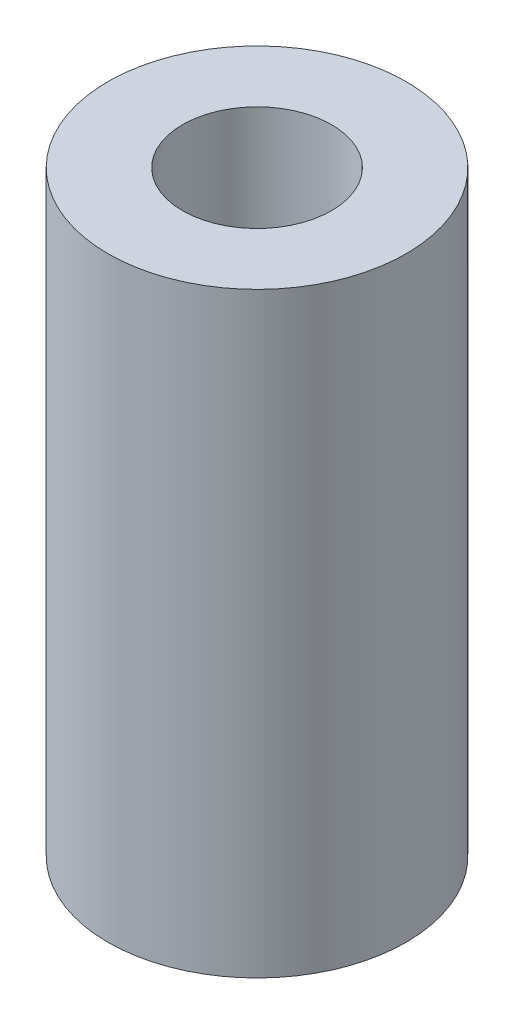
ISO-10303-21;
HEADER;
FILE_DESCRIPTION(('STEP AP214'),'2;1');
FILE_NAME('part.step','',(''),(''),'','','');
FILE_SCHEMA(('AUTOMOTIVE_DESIGN { 1 0 10303 214 1 1 1 1 }'));
ENDSEC;
DATA;
#1=APPLICATION_CONTEXT('core data for automotive mechanical design processes');
#2=APPLICATION_PROTOCOL_DEFINITION('international standard','automotive_design',2000,#1);
#3=PRODUCT_CONTEXT('',#1,'mechanical');
#4=PRODUCT('Part','Part','',(#3));
#5=PRODUCT_RELATED_PRODUCT_CATEGORY('part','',(#4));
#6=PRODUCT_DEFINITION_FORMATION('','',#4);
#7=PRODUCT_DEFINITION_CONTEXT('part definition',#1,'design');
#8=PRODUCT_DEFINITION('design','',#6,#7);
#9=PRODUCT_DEFINITION_SHAPE('','',#8);
#10=(LENGTH_UNIT() NAMED_UNIT(*) SI_UNIT(.MILLI.,.METRE.));
#11=(NAMED_UNIT(*) PLANE_ANGLE_UNIT() SI_UNIT($,.RADIAN.));
#12=(NAMED_UNIT(*) SI_UNIT($,.STERADIAN.) SOLID_ANGLE_UNIT());
#13=UNCERTAINTY_MEASURE_WITH_UNIT(LENGTH_MEASURE(1.E-05),#10,'distance_accuracy_value','');
#14=(GEOMETRIC_REPRESENTATION_CONTEXT(3) GLOBAL_UNCERTAINTY_ASSIGNED_CONTEXT((#13)) GLOBAL_UNIT_ASSIGNED_CONTEXT((#10,
#11,#12)) REPRESENTATION_CONTEXT('',''));
#15=CARTESIAN_POINT('',(0.,0.,0.));
#16=DIRECTION('',(0.,0.,1.));
#17=DIRECTION('',(1.,0.,0.));
#18=AXIS2_PLACEMENT_3D('',#15,#16,#17);
#19=CARTESIAN_POINT('',(0.,6.35,0.));
#20=DIRECTION('',(0.,1.,0.));
#21=DIRECTION('',(0.,0.,1.));
#22=AXIS2_PLACEMENT_3D('',#19,#20,#21);
#23=PLANE('',#22);
#24=CARTESIAN_POINT('',(0.,6.35,0.));
#25=DIRECTION('',(0.,1.,0.));
#26=DIRECTION('',(0.,0.,1.));
#27=AXIS2_PLACEMENT_3D('',#24,#25,#26);
#28=CIRCLE('',#27,1.5875);
#29=CARTESIAN_POINT('',(0.,6.35,1.5875));
#30=VERTEX_POINT('',#29);
#31=EDGE_CURVE('E10',#30,#30,#28,.T.);
#32=ORIENTED_EDGE('',*,*,#31,.T.);
#33=EDGE_LOOP('',(#32));
#34=FACE_BOUND('',#33,.T.);
#35=CARTESIAN_POINT('',(0.,6.35,0.));
#36=DIRECTION('',(0.,1.,0.));
#37=DIRECTION('',(0.,0.,1.));
#38=AXIS2_PLACEMENT_3D('',#35,#36,#37);
#39=CIRCLE('',#38,0.79375);
#40=CARTESIAN_POINT('',(0.,6.35,0.79375));
#41=VERTEX_POINT('',#40);
#42=EDGE_CURVE('E43',#41,#41,#39,.T.);
#43=ORIENTED_EDGE('',*,*,#42,.F.);
#44=EDGE_LOOP('',(#43));
#45=FACE_BOUND('',#44,.T.);
#46=ADVANCED_FACE('F32',(#34,#45),#23,.T.);
#47=CARTESIAN_POINT('',(0.,0.,0.));
#48=DIRECTION('',(0.,1.,0.));
#49=DIRECTION('',(0.,0.,1.));
#50=AXIS2_PLACEMENT_3D('',#47,#48,#49);
#51=PLANE('',#50);
#52=CARTESIAN_POINT('',(0.,0.,0.));
#53=DIRECTION('',(0.,1.,0.));
#54=DIRECTION('',(0.,0.,1.));
#55=AXIS2_PLACEMENT_3D('',#52,#53,#54);
#56=CIRCLE('',#55,1.5875);
#57=CARTESIAN_POINT('',(0.,0.,1.5875));
#58=VERTEX_POINT('',#57);
#59=EDGE_CURVE('E36',#58,#58,#56,.T.);
#60=ORIENTED_EDGE('',*,*,#59,.F.);
#61=EDGE_LOOP('',(#60));
#62=FACE_BOUND('',#61,.T.);
#63=CARTESIAN_POINT('',(0.,0.,0.));
#64=DIRECTION('',(0.,1.,0.));
#65=DIRECTION('',(0.,0.,1.));
#66=AXIS2_PLACEMENT_3D('',#63,#64,#65);
#67=CIRCLE('',#66,0.79375);
#68=CARTESIAN_POINT('',(0.,0.,0.79375));
#69=VERTEX_POINT('',#68);
#70=EDGE_CURVE('E45',#69,#69,#67,.T.);
#71=ORIENTED_EDGE('',*,*,#70,.T.);
#72=EDGE_LOOP('',(#71));
#73=FACE_BOUND('',#72,.T.);
#74=ADVANCED_FACE('F55',(#62,#73),#51,.F.);
#75=CARTESIAN_POINT('',(0.,6.35,0.));
#76=DIRECTION('',(0.,-1.,0.));
#77=DIRECTION('',(0.,0.,-1.));
#78=AXIS2_PLACEMENT_3D('',#75,#76,#77);
#79=CYLINDRICAL_SURFACE('',#78,1.5875);
#80=ORIENTED_EDGE('',*,*,#31,.F.);
#81=EDGE_LOOP('',(#80));
#82=FACE_BOUND('',#81,.T.);
#83=ORIENTED_EDGE('',*,*,#59,.T.);
#84=EDGE_LOOP('',(#83));
#85=FACE_BOUND('',#84,.T.);
#86=ADVANCED_FACE('F34',(#82,#85),#79,.T.);
#87=CARTESIAN_POINT('',(0.,6.35,0.));
#88=DIRECTION('',(0.,-1.,0.));
#89=DIRECTION('',(0.,0.,-1.));
#90=AXIS2_PLACEMENT_3D('',#87,#88,#89);
#91=CYLINDRICAL_SURFACE('',#90,0.79375);
#92=ORIENTED_EDGE('',*,*,#42,.T.);
#93=EDGE_LOOP('',(#92));
#94=FACE_BOUND('',#93,.T.);
#95=ORIENTED_EDGE('',*,*,#70,.F.);
#96=EDGE_LOOP('',(#95));
#97=FACE_BOUND('',#96,.T.);
#98=ADVANCED_FACE('F51',(#94,#97),#91,.F.);
#99=CLOSED_SHELL('',(#46,#74,#86,#98));
#100=MANIFOLD_SOLID_BREP('B2',#99);
#101=ADVANCED_BREP_SHAPE_REPRESENTATION('',(#18,#100),#14);
#102=SHAPE_DEFINITION_REPRESENTATION(#9,#101);
ENDSEC;
END-ISO-10303-21;
